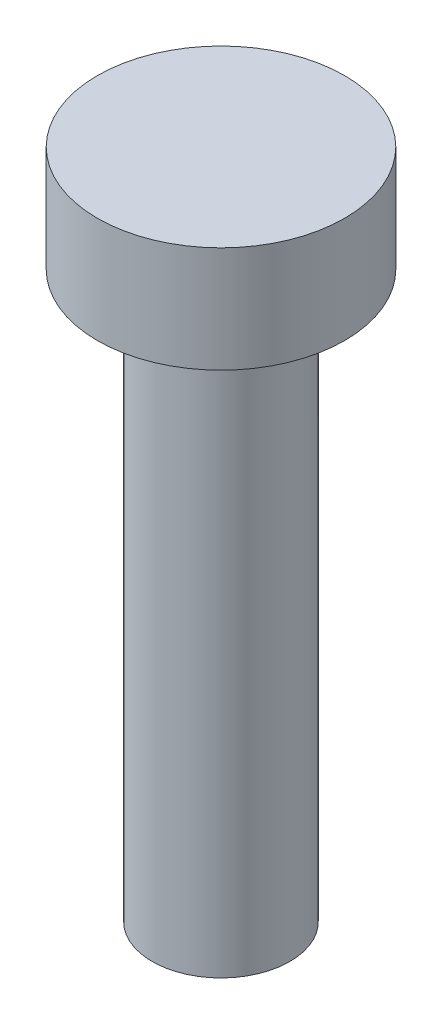
ISO-10303-21;
HEADER;
FILE_DESCRIPTION(('STEP AP214'),'2;1');
FILE_NAME('part.step','',(''),(''),'','','');
FILE_SCHEMA(('AUTOMOTIVE_DESIGN { 1 0 10303 214 1 1 1 1 }'));
ENDSEC;
DATA;
#1=APPLICATION_CONTEXT('core data for automotive mechanical design processes');
#2=APPLICATION_PROTOCOL_DEFINITION('international standard','automotive_design',2000,#1);
#3=PRODUCT_CONTEXT('',#1,'mechanical');
#4=PRODUCT('Part','Part','',(#3));
#5=PRODUCT_RELATED_PRODUCT_CATEGORY('part','',(#4));
#6=PRODUCT_DEFINITION_FORMATION('','',#4);
#7=PRODUCT_DEFINITION_CONTEXT('part definition',#1,'design');
#8=PRODUCT_DEFINITION('design','',#6,#7);
#9=PRODUCT_DEFINITION_SHAPE('','',#8);
#10=(LENGTH_UNIT() NAMED_UNIT(*) SI_UNIT(.MILLI.,.METRE.));
#11=(NAMED_UNIT(*) PLANE_ANGLE_UNIT() SI_UNIT($,.RADIAN.));
#12=(NAMED_UNIT(*) SI_UNIT($,.STERADIAN.) SOLID_ANGLE_UNIT());
#13=UNCERTAINTY_MEASURE_WITH_UNIT(LENGTH_MEASURE(1.E-05),#10,'distance_accuracy_value','');
#14=(GEOMETRIC_REPRESENTATION_CONTEXT(3) GLOBAL_UNCERTAINTY_ASSIGNED_CONTEXT((#13)) GLOBAL_UNIT_ASSIGNED_CONTEXT((#10,
#11,#12)) REPRESENTATION_CONTEXT('',''));
#15=CARTESIAN_POINT('',(0.,0.,0.));
#16=DIRECTION('',(0.,0.,1.));
#17=DIRECTION('',(1.,0.,0.));
#18=AXIS2_PLACEMENT_3D('',#15,#16,#17);
#19=CARTESIAN_POINT('',(0.,3.,0.));
#20=DIRECTION('',(0.,-1.,0.));
#21=DIRECTION('',(0.,0.,-1.));
#22=AXIS2_PLACEMENT_3D('',#19,#20,#21);
#23=CYLINDRICAL_SURFACE('',#22,3.5);
#24=CARTESIAN_POINT('',(0.,3.,0.));
#25=DIRECTION('',(0.,1.,0.));
#26=DIRECTION('',(0.,0.,1.));
#27=AXIS2_PLACEMENT_3D('',#24,#25,#26);
#28=CIRCLE('',#27,3.5);
#29=CARTESIAN_POINT('',(0.,3.,3.5));
#30=VERTEX_POINT('',#29);
#31=EDGE_CURVE('E45',#30,#30,#28,.T.);
#32=ORIENTED_EDGE('',*,*,#31,.F.);
#33=EDGE_LOOP('',(#32));
#34=FACE_BOUND('',#33,.T.);
#35=CARTESIAN_POINT('',(0.,0.,0.));
#36=DIRECTION('',(0.,1.,0.));
#37=DIRECTION('',(0.,0.,1.));
#38=AXIS2_PLACEMENT_3D('',#35,#36,#37);
#39=CIRCLE('',#38,3.5);
#40=CARTESIAN_POINT('',(0.,0.,3.5));
#41=VERTEX_POINT('',#40);
#42=EDGE_CURVE('E40',#41,#41,#39,.T.);
#43=ORIENTED_EDGE('',*,*,#42,.T.);
#44=EDGE_LOOP('',(#43));
#45=FACE_BOUND('',#44,.T.);
#46=ADVANCED_FACE('F37',(#34,#45),#23,.T.);
#47=CARTESIAN_POINT('',(0.,3.,0.));
#48=DIRECTION('',(0.,1.,0.));
#49=DIRECTION('',(0.,0.,1.));
#50=AXIS2_PLACEMENT_3D('',#47,#48,#49);
#51=PLANE('',#50);
#52=ORIENTED_EDGE('',*,*,#31,.T.);
#53=EDGE_LOOP('',(#52));
#54=FACE_BOUND('',#53,.T.);
#55=ADVANCED_FACE('F65',(#54),#51,.T.);
#56=CARTESIAN_POINT('',(0.,0.,0.));
#57=DIRECTION('',(0.,1.,0.));
#58=DIRECTION('',(0.,0.,1.));
#59=AXIS2_PLACEMENT_3D('',#56,#57,#58);
#60=PLANE('',#59);
#61=CARTESIAN_POINT('',(0.,0.,0.));
#62=DIRECTION('',(0.,-1.,0.));
#63=DIRECTION('',(0.,0.,-1.));
#64=AXIS2_PLACEMENT_3D('',#61,#62,#63);
#65=CIRCLE('',#64,1.95);
#66=CARTESIAN_POINT('',(0.,0.,-1.95));
#67=VERTEX_POINT('',#66);
#68=EDGE_CURVE('E10',#67,#67,#65,.T.);
#69=ORIENTED_EDGE('',*,*,#68,.F.);
#70=EDGE_LOOP('',(#69));
#71=FACE_BOUND('',#70,.T.);
#72=ORIENTED_EDGE('',*,*,#42,.F.);
#73=EDGE_LOOP('',(#72));
#74=FACE_BOUND('',#73,.T.);
#75=ADVANCED_FACE('F62',(#71,#74),#60,.F.);
#76=CARTESIAN_POINT('',(0.,-16.,0.));
#77=DIRECTION('',(0.,1.,0.));
#78=DIRECTION('',(0.,0.,1.));
#79=AXIS2_PLACEMENT_3D('',#76,#77,#78);
#80=CYLINDRICAL_SURFACE('',#79,1.95);
#81=CARTESIAN_POINT('',(0.,-16.,0.));
#82=DIRECTION('',(0.,-1.,0.));
#83=DIRECTION('',(0.,0.,-1.));
#84=AXIS2_PLACEMENT_3D('',#81,#82,#83);
#85=CIRCLE('',#84,1.95);
#86=CARTESIAN_POINT('',(0.,-16.,-1.95));
#87=VERTEX_POINT('',#86);
#88=EDGE_CURVE('E52',#87,#87,#85,.T.);
#89=ORIENTED_EDGE('',*,*,#88,.F.);
#90=EDGE_LOOP('',(#89));
#91=FACE_BOUND('',#90,.T.);
#92=ORIENTED_EDGE('',*,*,#68,.T.);
#93=EDGE_LOOP('',(#92));
#94=FACE_BOUND('',#93,.T.);
#95=ADVANCED_FACE('F64',(#91,#94),#80,.T.);
#96=CARTESIAN_POINT('',(0.,-16.,0.));
#97=DIRECTION('',(0.,-1.,0.));
#98=DIRECTION('',(0.,0.,-1.));
#99=AXIS2_PLACEMENT_3D('',#96,#97,#98);
#100=PLANE('',#99);
#101=ORIENTED_EDGE('',*,*,#88,.T.);
#102=EDGE_LOOP('',(#101));
#103=FACE_BOUND('',#102,.T.);
#104=ADVANCED_FACE('F71',(#103),#100,.T.);
#105=CLOSED_SHELL('',(#46,#55,#75,#95,#104));
#106=MANIFOLD_SOLID_BREP('B2',#105);
#107=ADVANCED_BREP_SHAPE_REPRESENTATION('',(#18,#106),#14);
#108=SHAPE_DEFINITION_REPRESENTATION(#9,#107);
ENDSEC;
END-ISO-10303-21;
